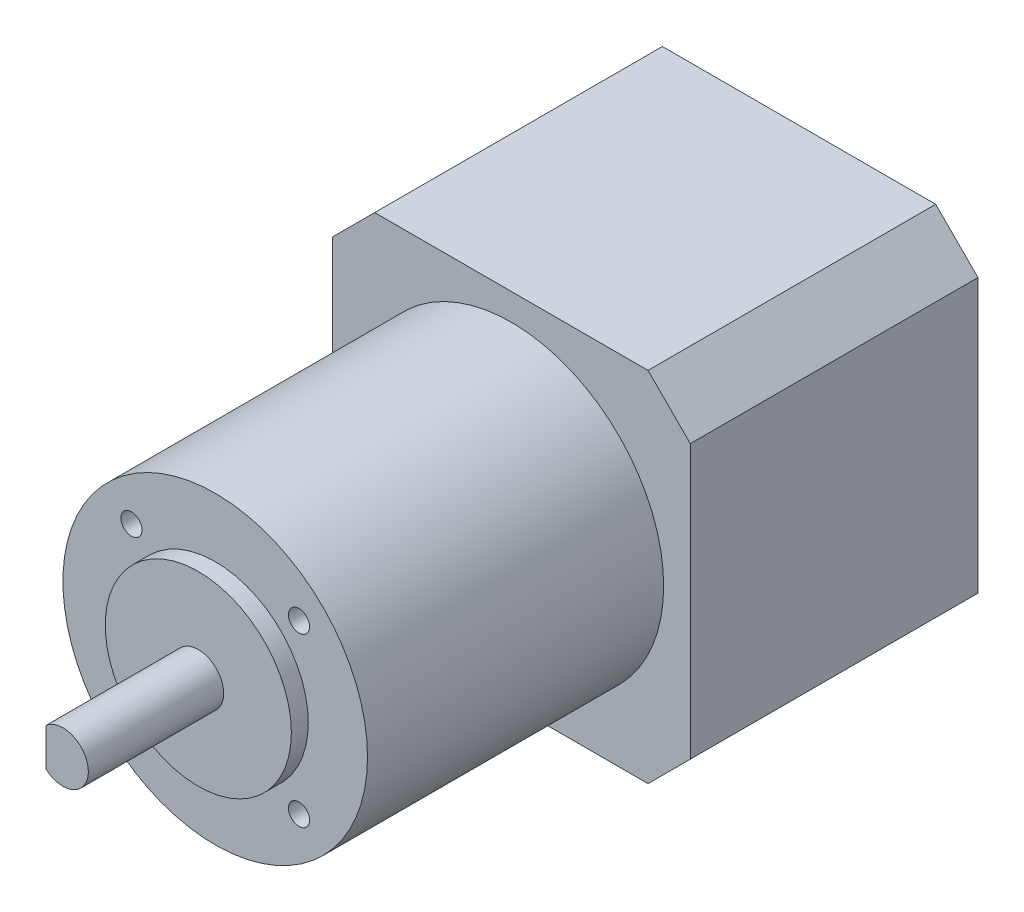
ISO-10303-21;
HEADER;
FILE_DESCRIPTION(('STEP AP214'),'2;1');
FILE_NAME('part.step','',(''),(''),'','','');
FILE_SCHEMA(('AUTOMOTIVE_DESIGN { 1 0 10303 214 1 1 1 1 }'));
ENDSEC;
DATA;
#1=APPLICATION_CONTEXT('core data for automotive mechanical design processes');
#2=APPLICATION_PROTOCOL_DEFINITION('international standard','automotive_design',2000,#1);
#3=PRODUCT_CONTEXT('',#1,'mechanical');
#4=PRODUCT('Part','Part','',(#3));
#5=PRODUCT_RELATED_PRODUCT_CATEGORY('part','',(#4));
#6=PRODUCT_DEFINITION_FORMATION('','',#4);
#7=PRODUCT_DEFINITION_CONTEXT('part definition',#1,'design');
#8=PRODUCT_DEFINITION('design','',#6,#7);
#9=PRODUCT_DEFINITION_SHAPE('','',#8);
#10=(LENGTH_UNIT() NAMED_UNIT(*) SI_UNIT(.MILLI.,.METRE.));
#11=(NAMED_UNIT(*) PLANE_ANGLE_UNIT() SI_UNIT($,.RADIAN.));
#12=(NAMED_UNIT(*) SI_UNIT($,.STERADIAN.) SOLID_ANGLE_UNIT());
#13=UNCERTAINTY_MEASURE_WITH_UNIT(LENGTH_MEASURE(1.E-05),#10,'distance_accuracy_value','');
#14=(GEOMETRIC_REPRESENTATION_CONTEXT(3) GLOBAL_UNCERTAINTY_ASSIGNED_CONTEXT((#13)) GLOBAL_UNIT_ASSIGNED_CONTEXT((#10,
#11,#12)) REPRESENTATION_CONTEXT('',''));
#15=CARTESIAN_POINT('',(0.,0.,0.));
#16=DIRECTION('',(0.,0.,1.));
#17=DIRECTION('',(1.,0.,0.));
#18=AXIS2_PLACEMENT_3D('',#15,#16,#17);
#19=CARTESIAN_POINT('',(-21.15,-21.15,34.));
#20=DIRECTION('',(-1.,0.,0.));
#21=DIRECTION('',(0.,0.,1.));
#22=AXIS2_PLACEMENT_3D('',#19,#20,#21);
#23=PLANE('',#22);
#24=DIRECTION('',(0.,1.,0.));
#25=VECTOR('',#24,1.);
#26=CARTESIAN_POINT('',(-21.15,-21.15,0.));
#27=LINE('',#26,#25);
#28=CARTESIAN_POINT('',(-21.15,-16.15,0.));
#29=VERTEX_POINT('',#28);
#30=CARTESIAN_POINT('',(-21.15,16.15,0.));
#31=VERTEX_POINT('',#30);
#32=EDGE_CURVE('E203',#29,#31,#27,.T.);
#33=ORIENTED_EDGE('',*,*,#32,.F.);
#34=DIRECTION('',(0.,0.,1.));
#35=VECTOR('',#34,1.);
#36=CARTESIAN_POINT('',(-21.15,-16.15,34.));
#37=LINE('',#36,#35);
#38=CARTESIAN_POINT('',(-21.15,-16.15,34.));
#39=VERTEX_POINT('',#38);
#40=EDGE_CURVE('E242',#29,#39,#37,.T.);
#41=ORIENTED_EDGE('',*,*,#40,.T.);
#42=DIRECTION('',(0.,1.,0.));
#43=VECTOR('',#42,1.);
#44=CARTESIAN_POINT('',(-21.15,-21.15,34.));
#45=LINE('',#44,#43);
#46=CARTESIAN_POINT('',(-21.15,16.15,34.));
#47=VERTEX_POINT('',#46);
#48=EDGE_CURVE('E207',#39,#47,#45,.T.);
#49=ORIENTED_EDGE('',*,*,#48,.T.);
#50=DIRECTION('',(0.,0.,-1.));
#51=VECTOR('',#50,1.);
#52=CARTESIAN_POINT('',(-21.15,16.15,34.));
#53=LINE('',#52,#51);
#54=EDGE_CURVE('E239',#47,#31,#53,.T.);
#55=ORIENTED_EDGE('',*,*,#54,.T.);
#56=EDGE_LOOP('',(#33,#41,#49,#55));
#57=FACE_BOUND('',#56,.T.);
#58=ADVANCED_FACE('F53',(#57),#23,.T.);
#59=CARTESIAN_POINT('',(-21.15,-21.15,34.));
#60=DIRECTION('',(0.,1.,0.));
#61=DIRECTION('',(0.,0.,1.));
#62=AXIS2_PLACEMENT_3D('',#59,#60,#61);
#63=PLANE('',#62);
#64=DIRECTION('',(1.,0.,0.));
#65=VECTOR('',#64,1.);
#66=CARTESIAN_POINT('',(-21.15,-21.15,34.));
#67=LINE('',#66,#65);
#68=CARTESIAN_POINT('',(-16.15,-21.15,34.));
#69=VERTEX_POINT('',#68);
#70=CARTESIAN_POINT('',(16.15,-21.15,34.));
#71=VERTEX_POINT('',#70);
#72=EDGE_CURVE('E206',#69,#71,#67,.T.);
#73=ORIENTED_EDGE('',*,*,#72,.F.);
#74=DIRECTION('',(0.,0.,-1.));
#75=VECTOR('',#74,1.);
#76=CARTESIAN_POINT('',(-16.15,-21.15,0.));
#77=LINE('',#76,#75);
#78=CARTESIAN_POINT('',(-16.15,-21.15,0.));
#79=VERTEX_POINT('',#78);
#80=EDGE_CURVE('E228',#69,#79,#77,.T.);
#81=ORIENTED_EDGE('',*,*,#80,.T.);
#82=DIRECTION('',(1.,0.,0.));
#83=VECTOR('',#82,1.);
#84=CARTESIAN_POINT('',(-21.15,-21.15,0.));
#85=LINE('',#84,#83);
#86=CARTESIAN_POINT('',(16.15,-21.15,0.));
#87=VERTEX_POINT('',#86);
#88=EDGE_CURVE('E211',#79,#87,#85,.T.);
#89=ORIENTED_EDGE('',*,*,#88,.T.);
#90=DIRECTION('',(0.,0.,1.));
#91=VECTOR('',#90,1.);
#92=CARTESIAN_POINT('',(16.15,-21.15,34.));
#93=LINE('',#92,#91);
#94=EDGE_CURVE('E193',#87,#71,#93,.T.);
#95=ORIENTED_EDGE('',*,*,#94,.T.);
#96=EDGE_LOOP('',(#73,#81,#89,#95));
#97=FACE_BOUND('',#96,.T.);
#98=ADVANCED_FACE('F278',(#97),#63,.F.);
#99=CARTESIAN_POINT('',(21.15,-21.15,34.));
#100=DIRECTION('',(-1.,0.,0.));
#101=DIRECTION('',(0.,0.,1.));
#102=AXIS2_PLACEMENT_3D('',#99,#100,#101);
#103=PLANE('',#102);
#104=DIRECTION('',(0.,1.,0.));
#105=VECTOR('',#104,1.);
#106=CARTESIAN_POINT('',(21.15,-21.15,34.));
#107=LINE('',#106,#105);
#108=CARTESIAN_POINT('',(21.15,-16.15,34.));
#109=VERTEX_POINT('',#108);
#110=CARTESIAN_POINT('',(21.15,16.15,34.));
#111=VERTEX_POINT('',#110);
#112=EDGE_CURVE('E213',#109,#111,#107,.T.);
#113=ORIENTED_EDGE('',*,*,#112,.F.);
#114=DIRECTION('',(0.,0.,-1.));
#115=VECTOR('',#114,1.);
#116=CARTESIAN_POINT('',(21.15,-16.15,34.));
#117=LINE('',#116,#115);
#118=CARTESIAN_POINT('',(21.15,-16.15,0.));
#119=VERTEX_POINT('',#118);
#120=EDGE_CURVE('E253',#109,#119,#117,.T.);
#121=ORIENTED_EDGE('',*,*,#120,.T.);
#122=DIRECTION('',(0.,1.,0.));
#123=VECTOR('',#122,1.);
#124=CARTESIAN_POINT('',(21.15,-21.15,0.));
#125=LINE('',#124,#123);
#126=CARTESIAN_POINT('',(21.15,16.15,0.));
#127=VERTEX_POINT('',#126);
#128=EDGE_CURVE('E222',#119,#127,#125,.T.);
#129=ORIENTED_EDGE('',*,*,#128,.T.);
#130=DIRECTION('',(0.,0.,1.));
#131=VECTOR('',#130,1.);
#132=CARTESIAN_POINT('',(21.15,16.15,34.));
#133=LINE('',#132,#131);
#134=EDGE_CURVE('E251',#127,#111,#133,.T.);
#135=ORIENTED_EDGE('',*,*,#134,.T.);
#136=EDGE_LOOP('',(#113,#121,#129,#135));
#137=FACE_BOUND('',#136,.T.);
#138=ADVANCED_FACE('F286',(#137),#103,.F.);
#139=CARTESIAN_POINT('',(-21.15,21.15,34.));
#140=DIRECTION('',(0.,1.,0.));
#141=DIRECTION('',(0.,0.,1.));
#142=AXIS2_PLACEMENT_3D('',#139,#140,#141);
#143=PLANE('',#142);
#144=DIRECTION('',(1.,0.,0.));
#145=VECTOR('',#144,1.);
#146=CARTESIAN_POINT('',(-21.15,21.15,0.));
#147=LINE('',#146,#145);
#148=CARTESIAN_POINT('',(-16.15,21.15,0.));
#149=VERTEX_POINT('',#148);
#150=CARTESIAN_POINT('',(16.15,21.15,0.));
#151=VERTEX_POINT('',#150);
#152=EDGE_CURVE('E219',#149,#151,#147,.T.);
#153=ORIENTED_EDGE('',*,*,#152,.F.);
#154=DIRECTION('',(0.,0.,1.));
#155=VECTOR('',#154,1.);
#156=CARTESIAN_POINT('',(-16.15,21.15,34.));
#157=LINE('',#156,#155);
#158=CARTESIAN_POINT('',(-16.15,21.15,34.));
#159=VERTEX_POINT('',#158);
#160=EDGE_CURVE('E11',#149,#159,#157,.T.);
#161=ORIENTED_EDGE('',*,*,#160,.T.);
#162=DIRECTION('',(1.,0.,0.));
#163=VECTOR('',#162,1.);
#164=CARTESIAN_POINT('',(-21.15,21.15,34.));
#165=LINE('',#164,#163);
#166=CARTESIAN_POINT('',(16.15,21.15,34.));
#167=VERTEX_POINT('',#166);
#168=EDGE_CURVE('E210',#159,#167,#165,.T.);
#169=ORIENTED_EDGE('',*,*,#168,.T.);
#170=DIRECTION('',(0.,0.,-1.));
#171=VECTOR('',#170,1.);
#172=CARTESIAN_POINT('',(16.15,21.15,0.));
#173=LINE('',#172,#171);
#174=EDGE_CURVE('E62',#167,#151,#173,.T.);
#175=ORIENTED_EDGE('',*,*,#174,.T.);
#176=EDGE_LOOP('',(#153,#161,#169,#175));
#177=FACE_BOUND('',#176,.T.);
#178=ADVANCED_FACE('F257',(#177),#143,.T.);
#179=CARTESIAN_POINT('',(0.,0.,34.));
#180=DIRECTION('',(0.,0.,-1.));
#181=DIRECTION('',(-1.,0.,0.));
#182=AXIS2_PLACEMENT_3D('',#179,#180,#181);
#183=PLANE('',#182);
#184=CARTESIAN_POINT('',(0.,0.,34.));
#185=DIRECTION('',(0.,0.,1.));
#186=DIRECTION('',(1.,0.,0.));
#187=AXIS2_PLACEMENT_3D('',#184,#185,#186);
#188=CIRCLE('',#187,18.);
#189=CARTESIAN_POINT('',(18.,0.,34.));
#190=VERTEX_POINT('',#189);
#191=EDGE_CURVE('E200',#190,#190,#188,.T.);
#192=ORIENTED_EDGE('',*,*,#191,.F.);
#193=EDGE_LOOP('',(#192));
#194=FACE_BOUND('',#193,.T.);
#195=ORIENTED_EDGE('',*,*,#48,.F.);
#196=DIRECTION('',(0.707106781186546,-0.707106781186549,0.));
#197=VECTOR('',#196,1.);
#198=CARTESIAN_POINT('',(-16.15,-21.15,34.));
#199=LINE('',#198,#197);
#200=EDGE_CURVE('E249',#39,#69,#199,.T.);
#201=ORIENTED_EDGE('',*,*,#200,.T.);
#202=ORIENTED_EDGE('',*,*,#72,.T.);
#203=DIRECTION('',(-0.707106781186549,-0.707106781186546,0.));
#204=VECTOR('',#203,1.);
#205=CARTESIAN_POINT('',(21.15,-16.15,34.));
#206=LINE('',#205,#204);
#207=EDGE_CURVE('E247',#71,#109,#206,.F.);
#208=ORIENTED_EDGE('',*,*,#207,.T.);
#209=ORIENTED_EDGE('',*,*,#112,.T.);
#210=DIRECTION('',(-0.707106781186546,0.707106781186549,0.));
#211=VECTOR('',#210,1.);
#212=CARTESIAN_POINT('',(16.15,21.15,34.));
#213=LINE('',#212,#211);
#214=EDGE_CURVE('E69',#111,#167,#213,.T.);
#215=ORIENTED_EDGE('',*,*,#214,.T.);
#216=ORIENTED_EDGE('',*,*,#168,.F.);
#217=DIRECTION('',(0.707106781186549,0.707106781186546,0.));
#218=VECTOR('',#217,1.);
#219=CARTESIAN_POINT('',(-21.15,16.15,34.));
#220=LINE('',#219,#218);
#221=EDGE_CURVE('E245',#159,#47,#220,.F.);
#222=ORIENTED_EDGE('',*,*,#221,.T.);
#223=EDGE_LOOP('',(#195,#201,#202,#208,#209,#215,#216,#222));
#224=FACE_BOUND('',#223,.T.);
#225=ADVANCED_FACE('F272',(#194,#224),#183,.F.);
#226=CARTESIAN_POINT('',(0.,0.,0.));
#227=DIRECTION('',(0.,0.,-1.));
#228=DIRECTION('',(-1.,0.,0.));
#229=AXIS2_PLACEMENT_3D('',#226,#227,#228);
#230=PLANE('',#229);
#231=ORIENTED_EDGE('',*,*,#88,.F.);
#232=DIRECTION('',(-0.707106781186546,0.707106781186549,0.));
#233=VECTOR('',#232,1.);
#234=CARTESIAN_POINT('',(-18.65,-18.6499999999999,0.));
#235=LINE('',#234,#233);
#236=EDGE_CURVE('E237',#79,#29,#235,.T.);
#237=ORIENTED_EDGE('',*,*,#236,.T.);
#238=ORIENTED_EDGE('',*,*,#32,.T.);
#239=DIRECTION('',(-0.707106781186549,-0.707106781186546,0.));
#240=VECTOR('',#239,1.);
#241=CARTESIAN_POINT('',(-18.6499999999999,18.65,0.));
#242=LINE('',#241,#240);
#243=EDGE_CURVE('E233',#31,#149,#242,.F.);
#244=ORIENTED_EDGE('',*,*,#243,.T.);
#245=ORIENTED_EDGE('',*,*,#152,.T.);
#246=DIRECTION('',(0.707106781186546,-0.707106781186549,0.));
#247=VECTOR('',#246,1.);
#248=CARTESIAN_POINT('',(18.65,18.6499999999999,0.));
#249=LINE('',#248,#247);
#250=EDGE_CURVE('E231',#151,#127,#249,.T.);
#251=ORIENTED_EDGE('',*,*,#250,.T.);
#252=ORIENTED_EDGE('',*,*,#128,.F.);
#253=DIRECTION('',(0.707106781186549,0.707106781186546,0.));
#254=VECTOR('',#253,1.);
#255=CARTESIAN_POINT('',(18.6499999999999,-18.65,0.));
#256=LINE('',#255,#254);
#257=EDGE_CURVE('E235',#119,#87,#256,.F.);
#258=ORIENTED_EDGE('',*,*,#257,.T.);
#259=EDGE_LOOP('',(#231,#237,#238,#244,#245,#251,#252,#258));
#260=FACE_BOUND('',#259,.T.);
#261=ADVANCED_FACE('F261',(#260),#230,.T.);
#262=CARTESIAN_POINT('',(0.,0.,69.));
#263=DIRECTION('',(0.,0.,-1.));
#264=DIRECTION('',(-1.,0.,0.));
#265=AXIS2_PLACEMENT_3D('',#262,#263,#264);
#266=CYLINDRICAL_SURFACE('',#265,18.);
#267=CARTESIAN_POINT('',(0.,0.,69.));
#268=DIRECTION('',(0.,0.,1.));
#269=DIRECTION('',(1.,0.,0.));
#270=AXIS2_PLACEMENT_3D('',#267,#268,#269);
#271=CIRCLE('',#270,18.);
#272=CARTESIAN_POINT('',(18.,0.,69.));
#273=VERTEX_POINT('',#272);
#274=EDGE_CURVE('E197',#273,#273,#271,.T.);
#275=ORIENTED_EDGE('',*,*,#274,.F.);
#276=EDGE_LOOP('',(#275));
#277=FACE_BOUND('',#276,.T.);
#278=ORIENTED_EDGE('',*,*,#191,.T.);
#279=EDGE_LOOP('',(#278));
#280=FACE_BOUND('',#279,.T.);
#281=ADVANCED_FACE('F446',(#277,#280),#266,.T.);
#282=CARTESIAN_POINT('',(0.,0.,69.));
#283=DIRECTION('',(0.,0.,1.));
#284=DIRECTION('',(1.,0.,0.));
#285=AXIS2_PLACEMENT_3D('',#282,#283,#284);
#286=PLANE('',#285);
#287=CARTESIAN_POINT('',(-9.89949493661167,9.89949493661167,69.));
#288=DIRECTION('',(0.,0.,1.));
#289=DIRECTION('',(1.,0.,0.));
#290=AXIS2_PLACEMENT_3D('',#287,#288,#289);
#291=CIRCLE('',#290,1.24999999999999);
#292=CARTESIAN_POINT('',(-8.64949493661168,9.89949493661167,69.));
#293=VERTEX_POINT('',#292);
#294=EDGE_CURVE('E152',#293,#293,#291,.T.);
#295=ORIENTED_EDGE('',*,*,#294,.F.);
#296=EDGE_LOOP('',(#295));
#297=FACE_BOUND('',#296,.T.);
#298=CARTESIAN_POINT('',(9.89949493661167,9.89949493661167,69.));
#299=DIRECTION('',(0.,0.,1.));
#300=DIRECTION('',(1.,0.,0.));
#301=AXIS2_PLACEMENT_3D('',#298,#299,#300);
#302=CIRCLE('',#301,1.24999999999999);
#303=CARTESIAN_POINT('',(11.1494949366117,9.89949493661167,69.));
#304=VERTEX_POINT('',#303);
#305=EDGE_CURVE('E151',#304,#304,#302,.T.);
#306=ORIENTED_EDGE('',*,*,#305,.F.);
#307=EDGE_LOOP('',(#306));
#308=FACE_BOUND('',#307,.T.);
#309=CARTESIAN_POINT('',(9.89949493661167,-9.89949493661167,69.));
#310=DIRECTION('',(0.,0.,1.));
#311=DIRECTION('',(1.,0.,0.));
#312=AXIS2_PLACEMENT_3D('',#309,#310,#311);
#313=CIRCLE('',#312,1.24999999999999);
#314=CARTESIAN_POINT('',(11.1494949366117,-9.89949493661167,69.));
#315=VERTEX_POINT('',#314);
#316=EDGE_CURVE('E162',#315,#315,#313,.T.);
#317=ORIENTED_EDGE('',*,*,#316,.F.);
#318=EDGE_LOOP('',(#317));
#319=FACE_BOUND('',#318,.T.);
#320=CARTESIAN_POINT('',(-9.89949493661167,-9.89949493661167,69.));
#321=DIRECTION('',(0.,0.,1.));
#322=DIRECTION('',(1.,0.,0.));
#323=AXIS2_PLACEMENT_3D('',#320,#321,#322);
#324=CIRCLE('',#323,1.24999999999999);
#325=CARTESIAN_POINT('',(-8.64949493661168,-9.89949493661167,69.));
#326=VERTEX_POINT('',#325);
#327=EDGE_CURVE('E168',#326,#326,#324,.T.);
#328=ORIENTED_EDGE('',*,*,#327,.F.);
#329=EDGE_LOOP('',(#328));
#330=FACE_BOUND('',#329,.T.);
#331=CARTESIAN_POINT('',(0.,0.,69.));
#332=DIRECTION('',(0.,0.,1.));
#333=DIRECTION('',(1.,0.,0.));
#334=AXIS2_PLACEMENT_3D('',#331,#332,#333);
#335=CIRCLE('',#334,11.);
#336=CARTESIAN_POINT('',(11.,0.,69.));
#337=VERTEX_POINT('',#336);
#338=EDGE_CURVE('E194',#337,#337,#335,.T.);
#339=ORIENTED_EDGE('',*,*,#338,.F.);
#340=EDGE_LOOP('',(#339));
#341=FACE_BOUND('',#340,.T.);
#342=ORIENTED_EDGE('',*,*,#274,.T.);
#343=EDGE_LOOP('',(#342));
#344=FACE_BOUND('',#343,.T.);
#345=ADVANCED_FACE('F442',(#297,#308,#319,#330,#341,#344),#286,.T.);
#346=CARTESIAN_POINT('',(0.,0.,71.));
#347=DIRECTION('',(0.,0.,-1.));
#348=DIRECTION('',(-1.,0.,0.));
#349=AXIS2_PLACEMENT_3D('',#346,#347,#348);
#350=CYLINDRICAL_SURFACE('',#349,11.);
#351=CARTESIAN_POINT('',(0.,0.,71.));
#352=DIRECTION('',(0.,0.,1.));
#353=DIRECTION('',(1.,0.,0.));
#354=AXIS2_PLACEMENT_3D('',#351,#352,#353);
#355=CIRCLE('',#354,11.);
#356=CARTESIAN_POINT('',(11.,0.,71.));
#357=VERTEX_POINT('',#356);
#358=EDGE_CURVE('E189',#357,#357,#355,.T.);
#359=ORIENTED_EDGE('',*,*,#358,.F.);
#360=EDGE_LOOP('',(#359));
#361=FACE_BOUND('',#360,.T.);
#362=ORIENTED_EDGE('',*,*,#338,.T.);
#363=EDGE_LOOP('',(#362));
#364=FACE_BOUND('',#363,.T.);
#365=ADVANCED_FACE('F445',(#361,#364),#350,.T.);
#366=CARTESIAN_POINT('',(0.,0.,71.));
#367=DIRECTION('',(0.,0.,1.));
#368=DIRECTION('',(1.,0.,0.));
#369=AXIS2_PLACEMENT_3D('',#366,#367,#368);
#370=PLANE('',#369);
#371=CARTESIAN_POINT('',(0.,0.,71.));
#372=DIRECTION('',(0.,0.,1.));
#373=DIRECTION('',(1.,0.,0.));
#374=AXIS2_PLACEMENT_3D('',#371,#372,#373);
#375=CIRCLE('',#374,3.);
#376=CARTESIAN_POINT('',(3.,0.,71.));
#377=VERTEX_POINT('',#376);
#378=EDGE_CURVE('E190',#377,#377,#375,.T.);
#379=ORIENTED_EDGE('',*,*,#378,.F.);
#380=EDGE_LOOP('',(#379));
#381=FACE_BOUND('',#380,.T.);
#382=ORIENTED_EDGE('',*,*,#358,.T.);
#383=EDGE_LOOP('',(#382));
#384=FACE_BOUND('',#383,.T.);
#385=ADVANCED_FACE('F474',(#381,#384),#370,.T.);
#386=CARTESIAN_POINT('',(0.,0.,87.));
#387=DIRECTION('',(0.,0.,-1.));
#388=DIRECTION('',(-1.,0.,0.));
#389=AXIS2_PLACEMENT_3D('',#386,#387,#388);
#390=CYLINDRICAL_SURFACE('',#389,3.);
#391=CARTESIAN_POINT('',(0.,0.,87.));
#392=DIRECTION('',(0.,0.,1.));
#393=DIRECTION('',(1.,0.,0.));
#394=AXIS2_PLACEMENT_3D('',#391,#392,#393);
#395=CIRCLE('',#394,3.);
#396=CARTESIAN_POINT('',(-2.,-2.23606797749979,87.));
#397=VERTEX_POINT('',#396);
#398=CARTESIAN_POINT('',(-2.,2.23606797749979,87.));
#399=VERTEX_POINT('',#398);
#400=EDGE_CURVE('E185',#397,#399,#395,.T.);
#401=ORIENTED_EDGE('',*,*,#400,.F.);
#402=DIRECTION('',(0.,0.,1.));
#403=VECTOR('',#402,1.);
#404=CARTESIAN_POINT('',(-2.,-2.23606797749979,75.));
#405=LINE('',#404,#403);
#406=CARTESIAN_POINT('',(-2.,-2.23606797749979,75.));
#407=VERTEX_POINT('',#406);
#408=EDGE_CURVE('E180',#407,#397,#405,.T.);
#409=ORIENTED_EDGE('',*,*,#408,.F.);
#410=CARTESIAN_POINT('',(0.,0.,75.));
#411=DIRECTION('',(0.,0.,1.));
#412=DIRECTION('',(1.,0.,0.));
#413=AXIS2_PLACEMENT_3D('',#410,#411,#412);
#414=CIRCLE('',#413,3.);
#415=CARTESIAN_POINT('',(-2.,2.23606797749979,75.));
#416=VERTEX_POINT('',#415);
#417=EDGE_CURVE('E175',#416,#407,#414,.T.);
#418=ORIENTED_EDGE('',*,*,#417,.F.);
#419=DIRECTION('',(0.,0.,1.));
#420=VECTOR('',#419,1.);
#421=CARTESIAN_POINT('',(-2.,2.23606797749979,75.));
#422=LINE('',#421,#420);
#423=EDGE_CURVE('E182',#416,#399,#422,.T.);
#424=ORIENTED_EDGE('',*,*,#423,.T.);
#425=EDGE_LOOP('',(#401,#409,#418,#424));
#426=FACE_BOUND('',#425,.T.);
#427=ORIENTED_EDGE('',*,*,#378,.T.);
#428=EDGE_LOOP('',(#427));
#429=FACE_BOUND('',#428,.T.);
#430=ADVANCED_FACE('F484',(#426,#429),#390,.T.);
#431=CARTESIAN_POINT('',(0.,0.,87.));
#432=DIRECTION('',(0.,0.,1.));
#433=DIRECTION('',(1.,0.,0.));
#434=AXIS2_PLACEMENT_3D('',#431,#432,#433);
#435=PLANE('',#434);
#436=DIRECTION('',(0.,1.,0.));
#437=VECTOR('',#436,1.);
#438=CARTESIAN_POINT('',(-2.,2.23606797749979,87.));
#439=LINE('',#438,#437);
#440=EDGE_CURVE('E174',#397,#399,#439,.T.);
#441=ORIENTED_EDGE('',*,*,#440,.F.);
#442=ORIENTED_EDGE('',*,*,#400,.T.);
#443=EDGE_LOOP('',(#441,#442));
#444=FACE_BOUND('',#443,.T.);
#445=ADVANCED_FACE('F494',(#444),#435,.T.);
#446=CARTESIAN_POINT('',(-2.,2.23606797749979,75.));
#447=DIRECTION('',(1.,0.,0.));
#448=DIRECTION('',(0.,0.,-1.));
#449=AXIS2_PLACEMENT_3D('',#446,#447,#448);
#450=PLANE('',#449);
#451=ORIENTED_EDGE('',*,*,#440,.T.);
#452=ORIENTED_EDGE('',*,*,#423,.F.);
#453=DIRECTION('',(0.,1.,0.));
#454=VECTOR('',#453,1.);
#455=CARTESIAN_POINT('',(-2.,2.23606797749979,75.));
#456=LINE('',#455,#454);
#457=EDGE_CURVE('E177',#407,#416,#456,.T.);
#458=ORIENTED_EDGE('',*,*,#457,.F.);
#459=ORIENTED_EDGE('',*,*,#408,.T.);
#460=EDGE_LOOP('',(#451,#452,#458,#459));
#461=FACE_BOUND('',#460,.T.);
#462=ADVANCED_FACE('F504',(#461),#450,.F.);
#463=CARTESIAN_POINT('',(0.,0.,75.));
#464=DIRECTION('',(0.,0.,1.));
#465=DIRECTION('',(1.,0.,0.));
#466=AXIS2_PLACEMENT_3D('',#463,#464,#465);
#467=PLANE('',#466);
#468=ORIENTED_EDGE('',*,*,#417,.T.);
#469=ORIENTED_EDGE('',*,*,#457,.T.);
#470=EDGE_LOOP('',(#468,#469));
#471=FACE_BOUND('',#470,.T.);
#472=ADVANCED_FACE('F314',(#471),#467,.T.);
#473=CARTESIAN_POINT('',(-16.15,-21.15,34.));
#474=DIRECTION('',(-0.707106781186549,-0.707106781186545,0.));
#475=DIRECTION('',(0.,0.,1.));
#476=AXIS2_PLACEMENT_3D('',#473,#474,#475);
#477=PLANE('',#476);
#478=ORIENTED_EDGE('',*,*,#200,.F.);
#479=ORIENTED_EDGE('',*,*,#40,.F.);
#480=ORIENTED_EDGE('',*,*,#236,.F.);
#481=ORIENTED_EDGE('',*,*,#80,.F.);
#482=EDGE_LOOP('',(#478,#479,#480,#481));
#483=FACE_BOUND('',#482,.T.);
#484=ADVANCED_FACE('F276',(#483),#477,.T.);
#485=CARTESIAN_POINT('',(21.15,-16.15,34.));
#486=DIRECTION('',(-0.707106781186545,0.707106781186549,0.));
#487=DIRECTION('',(0.,0.,-1.));
#488=AXIS2_PLACEMENT_3D('',#485,#486,#487);
#489=PLANE('',#488);
#490=ORIENTED_EDGE('',*,*,#207,.F.);
#491=ORIENTED_EDGE('',*,*,#94,.F.);
#492=ORIENTED_EDGE('',*,*,#257,.F.);
#493=ORIENTED_EDGE('',*,*,#120,.F.);
#494=EDGE_LOOP('',(#490,#491,#492,#493));
#495=FACE_BOUND('',#494,.T.);
#496=ADVANCED_FACE('F283',(#495),#489,.F.);
#497=CARTESIAN_POINT('',(-21.15,16.15,34.));
#498=DIRECTION('',(0.707106781186545,-0.707106781186549,0.));
#499=DIRECTION('',(0.,0.,-1.));
#500=AXIS2_PLACEMENT_3D('',#497,#498,#499);
#501=PLANE('',#500);
#502=ORIENTED_EDGE('',*,*,#221,.F.);
#503=ORIENTED_EDGE('',*,*,#160,.F.);
#504=ORIENTED_EDGE('',*,*,#243,.F.);
#505=ORIENTED_EDGE('',*,*,#54,.F.);
#506=EDGE_LOOP('',(#502,#503,#504,#505));
#507=FACE_BOUND('',#506,.T.);
#508=ADVANCED_FACE('F267',(#507),#501,.F.);
#509=CARTESIAN_POINT('',(16.15,21.15,34.));
#510=DIRECTION('',(0.707106781186549,0.707106781186545,0.));
#511=DIRECTION('',(0.,0.,1.));
#512=AXIS2_PLACEMENT_3D('',#509,#510,#511);
#513=PLANE('',#512);
#514=ORIENTED_EDGE('',*,*,#214,.F.);
#515=ORIENTED_EDGE('',*,*,#134,.F.);
#516=ORIENTED_EDGE('',*,*,#250,.F.);
#517=ORIENTED_EDGE('',*,*,#174,.F.);
#518=EDGE_LOOP('',(#514,#515,#516,#517));
#519=FACE_BOUND('',#518,.T.);
#520=ADVANCED_FACE('F56',(#519),#513,.T.);
#521=CARTESIAN_POINT('',(-9.89949493661167,-9.89949493661167,61.5));
#522=DIRECTION('',(0.,0.,1.));
#523=DIRECTION('',(1.,0.,0.));
#524=AXIS2_PLACEMENT_3D('',#521,#522,#523);
#525=CONICAL_SURFACE('',#524,1.25,1.02974425867665);
#526=CARTESIAN_POINT('',(-9.89949493661167,-9.89949493661167,60.7489242262156));
#527=VERTEX_POINT('',#526);
#528=VERTEX_LOOP('',#527);
#529=FACE_BOUND('',#528,.T.);
#530=CARTESIAN_POINT('',(-9.89949493661167,-9.89949493661167,61.5));
#531=DIRECTION('',(0.,0.,1.));
#532=DIRECTION('',(1.,0.,0.));
#533=AXIS2_PLACEMENT_3D('',#530,#531,#532);
#534=CIRCLE('',#533,1.25);
#535=CARTESIAN_POINT('',(-8.64949493661167,-9.89949493661167,61.5));
#536=VERTEX_POINT('',#535);
#537=EDGE_CURVE('E171',#536,#536,#534,.T.);
#538=ORIENTED_EDGE('',*,*,#537,.T.);
#539=EDGE_LOOP('',(#538));
#540=FACE_BOUND('',#539,.T.);
#541=ADVANCED_FACE('F289',(#529,#540),#525,.F.);
#542=CARTESIAN_POINT('',(-9.89949493661167,-9.89949493661167,69.));
#543=DIRECTION('',(0.,0.,1.));
#544=DIRECTION('',(1.,0.,0.));
#545=AXIS2_PLACEMENT_3D('',#542,#543,#544);
#546=CYLINDRICAL_SURFACE('',#545,1.24999999999999);
#547=ORIENTED_EDGE('',*,*,#537,.F.);
#548=EDGE_LOOP('',(#547));
#549=FACE_BOUND('',#548,.T.);
#550=ORIENTED_EDGE('',*,*,#327,.T.);
#551=EDGE_LOOP('',(#550));
#552=FACE_BOUND('',#551,.T.);
#553=ADVANCED_FACE('F295',(#549,#552),#546,.F.);
#554=CARTESIAN_POINT('',(9.89949493661167,-9.89949493661167,61.5));
#555=DIRECTION('',(0.,0.,1.));
#556=DIRECTION('',(1.,0.,0.));
#557=AXIS2_PLACEMENT_3D('',#554,#555,#556);
#558=CONICAL_SURFACE('',#557,1.25,1.02974425867665);
#559=CARTESIAN_POINT('',(9.89949493661167,-9.89949493661167,60.7489242262156));
#560=VERTEX_POINT('',#559);
#561=VERTEX_LOOP('',#560);
#562=FACE_BOUND('',#561,.T.);
#563=CARTESIAN_POINT('',(9.89949493661167,-9.89949493661167,61.5));
#564=DIRECTION('',(0.,0.,1.));
#565=DIRECTION('',(1.,0.,0.));
#566=AXIS2_PLACEMENT_3D('',#563,#564,#565);
#567=CIRCLE('',#566,1.25);
#568=CARTESIAN_POINT('',(11.1494949366117,-9.89949493661167,61.5));
#569=VERTEX_POINT('',#568);
#570=EDGE_CURVE('E165',#569,#569,#567,.T.);
#571=ORIENTED_EDGE('',*,*,#570,.T.);
#572=EDGE_LOOP('',(#571));
#573=FACE_BOUND('',#572,.T.);
#574=ADVANCED_FACE('F354',(#562,#573),#558,.F.);
#575=CARTESIAN_POINT('',(9.89949493661167,-9.89949493661167,69.));
#576=DIRECTION('',(0.,0.,1.));
#577=DIRECTION('',(1.,0.,0.));
#578=AXIS2_PLACEMENT_3D('',#575,#576,#577);
#579=CYLINDRICAL_SURFACE('',#578,1.24999999999999);
#580=ORIENTED_EDGE('',*,*,#570,.F.);
#581=EDGE_LOOP('',(#580));
#582=FACE_BOUND('',#581,.T.);
#583=ORIENTED_EDGE('',*,*,#316,.T.);
#584=EDGE_LOOP('',(#583));
#585=FACE_BOUND('',#584,.T.);
#586=ADVANCED_FACE('F365',(#582,#585),#579,.F.);
#587=CARTESIAN_POINT('',(9.89949493661167,9.89949493661167,61.5));
#588=DIRECTION('',(0.,0.,1.));
#589=DIRECTION('',(1.,0.,0.));
#590=AXIS2_PLACEMENT_3D('',#587,#588,#589);
#591=CONICAL_SURFACE('',#590,1.25,1.02974425867665);
#592=CARTESIAN_POINT('',(9.89949493661167,9.89949493661167,60.7489242262156));
#593=VERTEX_POINT('',#592);
#594=VERTEX_LOOP('',#593);
#595=FACE_BOUND('',#594,.T.);
#596=CARTESIAN_POINT('',(9.89949493661167,9.89949493661167,61.5));
#597=DIRECTION('',(0.,0.,1.));
#598=DIRECTION('',(1.,0.,0.));
#599=AXIS2_PLACEMENT_3D('',#596,#597,#598);
#600=CIRCLE('',#599,1.25);
#601=CARTESIAN_POINT('',(11.1494949366117,9.89949493661167,61.5));
#602=VERTEX_POINT('',#601);
#603=EDGE_CURVE('E155',#602,#602,#600,.T.);
#604=ORIENTED_EDGE('',*,*,#603,.T.);
#605=EDGE_LOOP('',(#604));
#606=FACE_BOUND('',#605,.T.);
#607=ADVANCED_FACE('F376',(#595,#606),#591,.F.);
#608=CARTESIAN_POINT('',(9.89949493661167,9.89949493661167,69.));
#609=DIRECTION('',(0.,0.,1.));
#610=DIRECTION('',(1.,0.,0.));
#611=AXIS2_PLACEMENT_3D('',#608,#609,#610);
#612=CYLINDRICAL_SURFACE('',#611,1.24999999999999);
#613=ORIENTED_EDGE('',*,*,#603,.F.);
#614=EDGE_LOOP('',(#613));
#615=FACE_BOUND('',#614,.T.);
#616=ORIENTED_EDGE('',*,*,#305,.T.);
#617=EDGE_LOOP('',(#616));
#618=FACE_BOUND('',#617,.T.);
#619=ADVANCED_FACE('F145',(#615,#618),#612,.F.);
#620=CARTESIAN_POINT('',(-9.89949493661167,9.89949493661167,61.5));
#621=DIRECTION('',(0.,0.,1.));
#622=DIRECTION('',(1.,0.,0.));
#623=AXIS2_PLACEMENT_3D('',#620,#621,#622);
#624=CONICAL_SURFACE('',#623,1.25,1.02974425867665);
#625=CARTESIAN_POINT('',(-9.89949493661167,9.89949493661167,60.7489242262156));
#626=VERTEX_POINT('',#625);
#627=VERTEX_LOOP('',#626);
#628=FACE_BOUND('',#627,.T.);
#629=CARTESIAN_POINT('',(-9.89949493661167,9.89949493661167,61.5));
#630=DIRECTION('',(0.,0.,1.));
#631=DIRECTION('',(1.,0.,0.));
#632=AXIS2_PLACEMENT_3D('',#629,#630,#631);
#633=CIRCLE('',#632,1.25);
#634=CARTESIAN_POINT('',(-8.64949493661167,9.89949493661167,61.5));
#635=VERTEX_POINT('',#634);
#636=EDGE_CURVE('E149',#635,#635,#633,.T.);
#637=ORIENTED_EDGE('',*,*,#636,.T.);
#638=EDGE_LOOP('',(#637));
#639=FACE_BOUND('',#638,.T.);
#640=ADVANCED_FACE('F141',(#628,#639),#624,.F.);
#641=CARTESIAN_POINT('',(-9.89949493661167,9.89949493661167,69.));
#642=DIRECTION('',(0.,0.,1.));
#643=DIRECTION('',(1.,0.,0.));
#644=AXIS2_PLACEMENT_3D('',#641,#642,#643);
#645=CYLINDRICAL_SURFACE('',#644,1.24999999999999);
#646=ORIENTED_EDGE('',*,*,#636,.F.);
#647=EDGE_LOOP('',(#646));
#648=FACE_BOUND('',#647,.T.);
#649=ORIENTED_EDGE('',*,*,#294,.T.);
#650=EDGE_LOOP('',(#649));
#651=FACE_BOUND('',#650,.T.);
#652=ADVANCED_FACE('F144',(#648,#651),#645,.F.);
#653=CLOSED_SHELL('',(#58,#98,#138,#178,#225,#261,#281,#345,#365,#385,#430,#445,#462,#472,#484,
#496,#508,#520,#541,#553,#574,#586,#607,#619,#640,#652));
#654=MANIFOLD_SOLID_BREP('B2',#653);
#655=ADVANCED_BREP_SHAPE_REPRESENTATION('',(#18,#654),#14);
#656=SHAPE_DEFINITION_REPRESENTATION(#9,#655);
ENDSEC;
END-ISO-10303-21;
